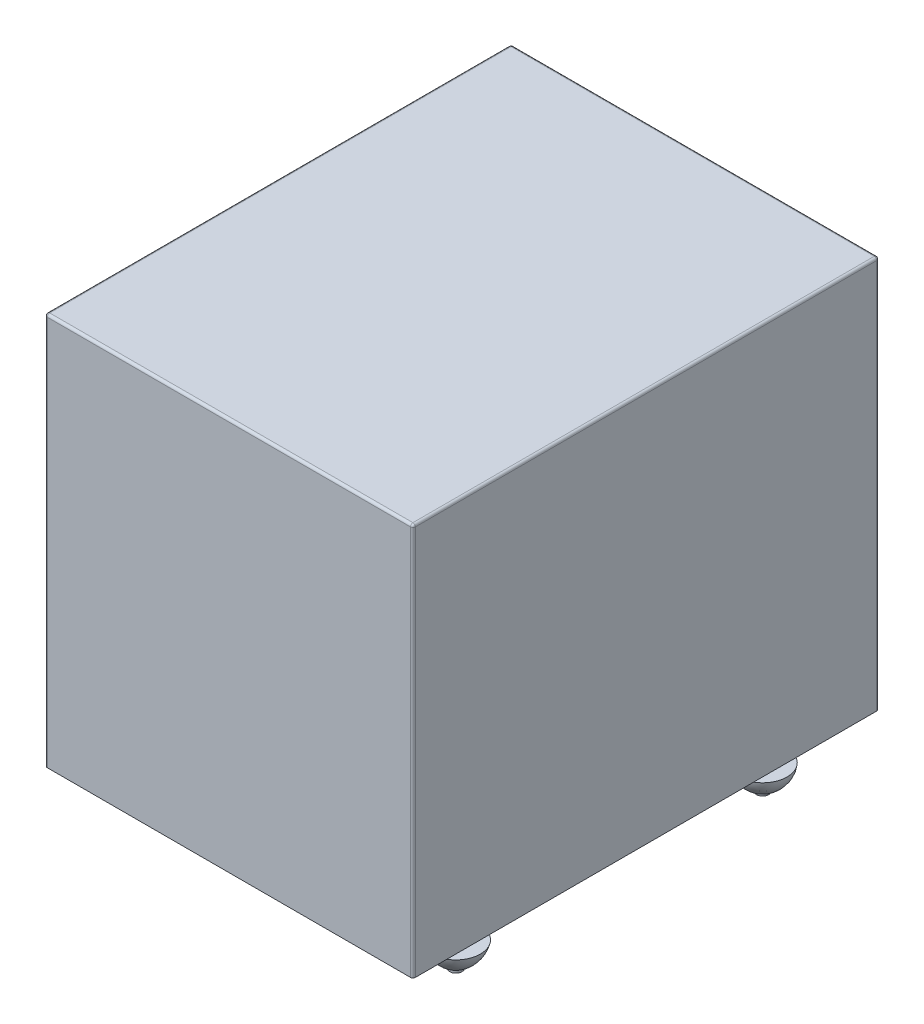
ISO-10303-21;
HEADER;
FILE_DESCRIPTION(('STEP AP214'),'2;1');
FILE_NAME('part.step','',(''),(''),'','','');
FILE_SCHEMA(('AUTOMOTIVE_DESIGN { 1 0 10303 214 1 1 1 1 }'));
ENDSEC;
DATA;
#1=APPLICATION_CONTEXT('core data for automotive mechanical design processes');
#2=APPLICATION_PROTOCOL_DEFINITION('international standard','automotive_design',2000,#1);
#3=PRODUCT_CONTEXT('',#1,'mechanical');
#4=PRODUCT('Part','Part','',(#3));
#5=PRODUCT_RELATED_PRODUCT_CATEGORY('part','',(#4));
#6=PRODUCT_DEFINITION_FORMATION('','',#4);
#7=PRODUCT_DEFINITION_CONTEXT('part definition',#1,'design');
#8=PRODUCT_DEFINITION('design','',#6,#7);
#9=PRODUCT_DEFINITION_SHAPE('','',#8);
#10=(LENGTH_UNIT() NAMED_UNIT(*) SI_UNIT(.MILLI.,.METRE.));
#11=(NAMED_UNIT(*) PLANE_ANGLE_UNIT() SI_UNIT($,.RADIAN.));
#12=(NAMED_UNIT(*) SI_UNIT($,.STERADIAN.) SOLID_ANGLE_UNIT());
#13=UNCERTAINTY_MEASURE_WITH_UNIT(LENGTH_MEASURE(1.E-05),#10,'distance_accuracy_value','');
#14=(GEOMETRIC_REPRESENTATION_CONTEXT(3) GLOBAL_UNCERTAINTY_ASSIGNED_CONTEXT((#13)) GLOBAL_UNIT_ASSIGNED_CONTEXT((#10,
#11,#12)) REPRESENTATION_CONTEXT('',''));
#15=CARTESIAN_POINT('',(0.,0.,0.));
#16=DIRECTION('',(0.,0.,1.));
#17=DIRECTION('',(1.,0.,0.));
#18=AXIS2_PLACEMENT_3D('',#15,#16,#17);
#19=CARTESIAN_POINT('',(6.,-2.,6.25));
#20=DIRECTION('',(0.,1.,0.));
#21=DIRECTION('',(0.,0.,1.));
#22=AXIS2_PLACEMENT_3D('',#19,#20,#21);
#23=CYLINDRICAL_SURFACE('',#22,0.25);
#24=CARTESIAN_POINT('',(6.,0.,6.25));
#25=DIRECTION('',(0.,1.,0.));
#26=DIRECTION('',(0.,0.,1.));
#27=AXIS2_PLACEMENT_3D('',#24,#25,#26);
#28=CIRCLE('',#27,0.25);
#29=CARTESIAN_POINT('',(6.,0.,6.5));
#30=VERTEX_POINT('',#29);
#31=EDGE_CURVE('E190',#30,#30,#28,.F.);
#32=ORIENTED_EDGE('',*,*,#31,.T.);
#33=EDGE_LOOP('',(#32));
#34=FACE_BOUND('',#33,.T.);
#35=CARTESIAN_POINT('',(6.,-1.,6.25));
#36=DIRECTION('',(0.,-1.,0.));
#37=DIRECTION('',(0.,0.,-1.));
#38=AXIS2_PLACEMENT_3D('',#35,#36,#37);
#39=CIRCLE('',#38,0.25);
#40=CARTESIAN_POINT('',(6.,-1.,6.));
#41=VERTEX_POINT('',#40);
#42=EDGE_CURVE('E44',#41,#41,#39,.T.);
#43=ORIENTED_EDGE('',*,*,#42,.F.);
#44=EDGE_LOOP('',(#43));
#45=FACE_BOUND('',#44,.T.);
#46=ADVANCED_FACE('F35',(#34,#45),#23,.T.);
#47=CARTESIAN_POINT('',(7.49999999999999,16.,-9.5));
#48=DIRECTION('',(-1.,0.,0.));
#49=DIRECTION('',(0.,0.,1.));
#50=AXIS2_PLACEMENT_3D('',#47,#48,#49);
#51=PLANE('',#50);
#52=DIRECTION('',(0.,0.,-1.));
#53=VECTOR('',#52,1.);
#54=CARTESIAN_POINT('',(7.49999999999999,0.,-9.5));
#55=LINE('',#54,#53);
#56=CARTESIAN_POINT('',(7.5,0.,9.4));
#57=VERTEX_POINT('',#56);
#58=CARTESIAN_POINT('',(7.49999999999999,0.,-9.4));
#59=VERTEX_POINT('',#58);
#60=EDGE_CURVE('E155',#57,#59,#55,.T.);
#61=ORIENTED_EDGE('',*,*,#60,.T.);
#62=DIRECTION('',(0.,-1.,0.));
#63=VECTOR('',#62,1.);
#64=CARTESIAN_POINT('',(7.49999999999999,16.,-9.4));
#65=LINE('',#64,#63);
#66=CARTESIAN_POINT('',(7.49999999999999,15.9,-9.4));
#67=VERTEX_POINT('',#66);
#68=EDGE_CURVE('E179',#59,#67,#65,.F.);
#69=ORIENTED_EDGE('',*,*,#68,.T.);
#70=DIRECTION('',(0.,0.,-1.));
#71=VECTOR('',#70,1.);
#72=CARTESIAN_POINT('',(7.5,15.9,9.5));
#73=LINE('',#72,#71);
#74=CARTESIAN_POINT('',(7.5,15.9,9.4));
#75=VERTEX_POINT('',#74);
#76=EDGE_CURVE('E175',#67,#75,#73,.F.);
#77=ORIENTED_EDGE('',*,*,#76,.T.);
#78=DIRECTION('',(0.,-1.,0.));
#79=VECTOR('',#78,1.);
#80=CARTESIAN_POINT('',(7.5,16.,9.4));
#81=LINE('',#80,#79);
#82=EDGE_CURVE('E177',#75,#57,#81,.T.);
#83=ORIENTED_EDGE('',*,*,#82,.T.);
#84=EDGE_LOOP('',(#61,#69,#77,#83));
#85=FACE_BOUND('',#84,.T.);
#86=ADVANCED_FACE('F367',(#85),#51,.F.);
#87=CARTESIAN_POINT('',(-7.5,16.,-9.5));
#88=DIRECTION('',(0.,0.,1.));
#89=DIRECTION('',(1.,0.,0.));
#90=AXIS2_PLACEMENT_3D('',#87,#88,#89);
#91=PLANE('',#90);
#92=DIRECTION('',(-1.,0.,0.));
#93=VECTOR('',#92,1.);
#94=CARTESIAN_POINT('',(-7.5,0.,-9.5));
#95=LINE('',#94,#93);
#96=CARTESIAN_POINT('',(7.39999999999999,0.,-9.5));
#97=VERTEX_POINT('',#96);
#98=CARTESIAN_POINT('',(-7.4,0.,-9.5));
#99=VERTEX_POINT('',#98);
#100=EDGE_CURVE('E151',#97,#99,#95,.T.);
#101=ORIENTED_EDGE('',*,*,#100,.T.);
#102=DIRECTION('',(0.,-1.,0.));
#103=VECTOR('',#102,1.);
#104=CARTESIAN_POINT('',(-7.4,16.,-9.5));
#105=LINE('',#104,#103);
#106=CARTESIAN_POINT('',(-7.4,15.9,-9.5));
#107=VERTEX_POINT('',#106);
#108=EDGE_CURVE('E128',#99,#107,#105,.F.);
#109=ORIENTED_EDGE('',*,*,#108,.T.);
#110=DIRECTION('',(-1.,0.,0.));
#111=VECTOR('',#110,1.);
#112=CARTESIAN_POINT('',(7.49999999999999,15.9,-9.5));
#113=LINE('',#112,#111);
#114=CARTESIAN_POINT('',(7.39999999999999,15.9,-9.5));
#115=VERTEX_POINT('',#114);
#116=EDGE_CURVE('E133',#107,#115,#113,.F.);
#117=ORIENTED_EDGE('',*,*,#116,.T.);
#118=DIRECTION('',(0.,-1.,0.));
#119=VECTOR('',#118,1.);
#120=CARTESIAN_POINT('',(7.39999999999999,16.,-9.5));
#121=LINE('',#120,#119);
#122=EDGE_CURVE('E166',#115,#97,#121,.T.);
#123=ORIENTED_EDGE('',*,*,#122,.T.);
#124=EDGE_LOOP('',(#101,#109,#117,#123));
#125=FACE_BOUND('',#124,.T.);
#126=ADVANCED_FACE('F416',(#125),#91,.F.);
#127=CARTESIAN_POINT('',(-7.5,16.,-9.5));
#128=DIRECTION('',(1.,0.,0.));
#129=DIRECTION('',(0.,0.,-1.));
#130=AXIS2_PLACEMENT_3D('',#127,#128,#129);
#131=PLANE('',#130);
#132=DIRECTION('',(0.,0.,1.));
#133=VECTOR('',#132,1.);
#134=CARTESIAN_POINT('',(-7.5,15.9,-9.5));
#135=LINE('',#134,#133);
#136=CARTESIAN_POINT('',(-7.5,15.9,9.4));
#137=VERTEX_POINT('',#136);
#138=CARTESIAN_POINT('',(-7.5,15.9,-9.4));
#139=VERTEX_POINT('',#138);
#140=EDGE_CURVE('E142',#137,#139,#135,.F.);
#141=ORIENTED_EDGE('',*,*,#140,.T.);
#142=DIRECTION('',(0.,-1.,0.));
#143=VECTOR('',#142,1.);
#144=CARTESIAN_POINT('',(-7.5,16.,-9.4));
#145=LINE('',#144,#143);
#146=CARTESIAN_POINT('',(-7.5,0.,-9.4));
#147=VERTEX_POINT('',#146);
#148=EDGE_CURVE('E127',#139,#147,#145,.T.);
#149=ORIENTED_EDGE('',*,*,#148,.T.);
#150=DIRECTION('',(0.,0.,1.));
#151=VECTOR('',#150,1.);
#152=CARTESIAN_POINT('',(-7.5,0.,-9.5));
#153=LINE('',#152,#151);
#154=CARTESIAN_POINT('',(-7.5,0.,9.4));
#155=VERTEX_POINT('',#154);
#156=EDGE_CURVE('E139',#147,#155,#153,.T.);
#157=ORIENTED_EDGE('',*,*,#156,.T.);
#158=DIRECTION('',(0.,-1.,0.));
#159=VECTOR('',#158,1.);
#160=CARTESIAN_POINT('',(-7.5,16.,9.4));
#161=LINE('',#160,#159);
#162=EDGE_CURVE('E145',#155,#137,#161,.F.);
#163=ORIENTED_EDGE('',*,*,#162,.T.);
#164=EDGE_LOOP('',(#141,#149,#157,#163));
#165=FACE_BOUND('',#164,.T.);
#166=ADVANCED_FACE('F138',(#165),#131,.F.);
#167=CARTESIAN_POINT('',(-7.5,16.,9.5));
#168=DIRECTION('',(0.,0.,-1.));
#169=DIRECTION('',(-1.,0.,0.));
#170=AXIS2_PLACEMENT_3D('',#167,#168,#169);
#171=PLANE('',#170);
#172=DIRECTION('',(1.,0.,0.));
#173=VECTOR('',#172,1.);
#174=CARTESIAN_POINT('',(-7.5,15.9,9.5));
#175=LINE('',#174,#173);
#176=CARTESIAN_POINT('',(7.4,15.9,9.5));
#177=VERTEX_POINT('',#176);
#178=CARTESIAN_POINT('',(-7.4,15.9,9.5));
#179=VERTEX_POINT('',#178);
#180=EDGE_CURVE('E169',#177,#179,#175,.F.);
#181=ORIENTED_EDGE('',*,*,#180,.T.);
#182=DIRECTION('',(0.,-1.,0.));
#183=VECTOR('',#182,1.);
#184=CARTESIAN_POINT('',(-7.4,16.,9.5));
#185=LINE('',#184,#183);
#186=CARTESIAN_POINT('',(-7.4,0.,9.5));
#187=VERTEX_POINT('',#186);
#188=EDGE_CURVE('E173',#179,#187,#185,.T.);
#189=ORIENTED_EDGE('',*,*,#188,.T.);
#190=DIRECTION('',(1.,0.,0.));
#191=VECTOR('',#190,1.);
#192=CARTESIAN_POINT('',(-7.5,0.,9.5));
#193=LINE('',#192,#191);
#194=CARTESIAN_POINT('',(7.4,0.,9.5));
#195=VERTEX_POINT('',#194);
#196=EDGE_CURVE('E150',#187,#195,#193,.T.);
#197=ORIENTED_EDGE('',*,*,#196,.T.);
#198=DIRECTION('',(0.,-1.,0.));
#199=VECTOR('',#198,1.);
#200=CARTESIAN_POINT('',(7.4,16.,9.5));
#201=LINE('',#200,#199);
#202=EDGE_CURVE('E171',#195,#177,#201,.F.);
#203=ORIENTED_EDGE('',*,*,#202,.T.);
#204=EDGE_LOOP('',(#181,#189,#197,#203));
#205=FACE_BOUND('',#204,.T.);
#206=ADVANCED_FACE('F398',(#205),#171,.F.);
#207=CARTESIAN_POINT('',(0.,16.,0.));
#208=DIRECTION('',(0.,1.,0.));
#209=DIRECTION('',(0.,0.,1.));
#210=AXIS2_PLACEMENT_3D('',#207,#208,#209);
#211=PLANE('',#210);
#212=DIRECTION('',(-1.,0.,0.));
#213=VECTOR('',#212,1.);
#214=CARTESIAN_POINT('',(-7.5,16.,-9.4));
#215=LINE('',#214,#213);
#216=CARTESIAN_POINT('',(7.39999999999999,16.,-9.4));
#217=VERTEX_POINT('',#216);
#218=CARTESIAN_POINT('',(-7.4,16.,-9.4));
#219=VERTEX_POINT('',#218);
#220=EDGE_CURVE('E185',#217,#219,#215,.T.);
#221=ORIENTED_EDGE('',*,*,#220,.T.);
#222=DIRECTION('',(0.,0.,1.));
#223=VECTOR('',#222,1.);
#224=CARTESIAN_POINT('',(-7.4,16.,9.5));
#225=LINE('',#224,#223);
#226=CARTESIAN_POINT('',(-7.4,16.,9.4));
#227=VERTEX_POINT('',#226);
#228=EDGE_CURVE('E187',#219,#227,#225,.T.);
#229=ORIENTED_EDGE('',*,*,#228,.T.);
#230=DIRECTION('',(1.,0.,0.));
#231=VECTOR('',#230,1.);
#232=CARTESIAN_POINT('',(7.5,16.,9.4));
#233=LINE('',#232,#231);
#234=CARTESIAN_POINT('',(7.4,16.,9.4));
#235=VERTEX_POINT('',#234);
#236=EDGE_CURVE('E181',#227,#235,#233,.T.);
#237=ORIENTED_EDGE('',*,*,#236,.T.);
#238=DIRECTION('',(0.,0.,-1.));
#239=VECTOR('',#238,1.);
#240=CARTESIAN_POINT('',(7.39999999999999,16.,-9.5));
#241=LINE('',#240,#239);
#242=EDGE_CURVE('E183',#235,#217,#241,.T.);
#243=ORIENTED_EDGE('',*,*,#242,.T.);
#244=EDGE_LOOP('',(#221,#229,#237,#243));
#245=FACE_BOUND('',#244,.T.);
#246=ADVANCED_FACE('F624',(#245),#211,.T.);
#247=CARTESIAN_POINT('',(0.,0.,0.));
#248=DIRECTION('',(0.,1.,0.));
#249=DIRECTION('',(0.,0.,1.));
#250=AXIS2_PLACEMENT_3D('',#247,#248,#249);
#251=PLANE('',#250);
#252=CARTESIAN_POINT('',(0.,0.,-8.25));
#253=DIRECTION('',(0.,1.,0.));
#254=DIRECTION('',(0.,0.,1.));
#255=AXIS2_PLACEMENT_3D('',#252,#253,#254);
#256=CIRCLE('',#255,0.25);
#257=CARTESIAN_POINT('',(0.,0.,-8.));
#258=VERTEX_POINT('',#257);
#259=EDGE_CURVE('E237',#258,#258,#256,.F.);
#260=ORIENTED_EDGE('',*,*,#259,.F.);
#261=EDGE_LOOP('',(#260));
#262=FACE_BOUND('',#261,.T.);
#263=CARTESIAN_POINT('',(-6.,0.,-6.25));
#264=DIRECTION('',(0.,1.,0.));
#265=DIRECTION('',(0.,0.,1.));
#266=AXIS2_PLACEMENT_3D('',#263,#264,#265);
#267=CIRCLE('',#266,0.250000000000002);
#268=CARTESIAN_POINT('',(-6.,0.,-6.));
#269=VERTEX_POINT('',#268);
#270=EDGE_CURVE('E234',#269,#269,#267,.F.);
#271=ORIENTED_EDGE('',*,*,#270,.F.);
#272=EDGE_LOOP('',(#271));
#273=FACE_BOUND('',#272,.T.);
#274=CARTESIAN_POINT('',(6.,0.,-6.25));
#275=DIRECTION('',(0.,1.,0.));
#276=DIRECTION('',(0.,0.,1.));
#277=AXIS2_PLACEMENT_3D('',#274,#275,#276);
#278=CIRCLE('',#277,0.249999999999999);
#279=CARTESIAN_POINT('',(6.,0.,-6.));
#280=VERTEX_POINT('',#279);
#281=EDGE_CURVE('E231',#280,#280,#278,.F.);
#282=ORIENTED_EDGE('',*,*,#281,.F.);
#283=EDGE_LOOP('',(#282));
#284=FACE_BOUND('',#283,.T.);
#285=CARTESIAN_POINT('',(-6.,0.,6.25));
#286=DIRECTION('',(0.,1.,0.));
#287=DIRECTION('',(0.,0.,1.));
#288=AXIS2_PLACEMENT_3D('',#285,#286,#287);
#289=CIRCLE('',#288,0.25);
#290=CARTESIAN_POINT('',(-6.,0.,6.5));
#291=VERTEX_POINT('',#290);
#292=EDGE_CURVE('E228',#291,#291,#289,.F.);
#293=ORIENTED_EDGE('',*,*,#292,.F.);
#294=EDGE_LOOP('',(#293));
#295=FACE_BOUND('',#294,.T.);
#296=ORIENTED_EDGE('',*,*,#31,.F.);
#297=EDGE_LOOP('',(#296));
#298=FACE_BOUND('',#297,.T.);
#299=ORIENTED_EDGE('',*,*,#156,.F.);
#300=CARTESIAN_POINT('',(-7.4,0.,-9.4));
#301=DIRECTION('',(0.,1.,0.));
#302=DIRECTION('',(0.,0.,1.));
#303=AXIS2_PLACEMENT_3D('',#300,#301,#302);
#304=CIRCLE('',#303,0.1);
#305=EDGE_CURVE('E123',#147,#99,#304,.F.);
#306=ORIENTED_EDGE('',*,*,#305,.T.);
#307=ORIENTED_EDGE('',*,*,#100,.F.);
#308=CARTESIAN_POINT('',(7.39999999999999,0.,-9.4));
#309=DIRECTION('',(0.,1.,0.));
#310=DIRECTION('',(0.,0.,1.));
#311=AXIS2_PLACEMENT_3D('',#308,#309,#310);
#312=CIRCLE('',#311,0.1);
#313=EDGE_CURVE('E162',#97,#59,#312,.F.);
#314=ORIENTED_EDGE('',*,*,#313,.T.);
#315=ORIENTED_EDGE('',*,*,#60,.F.);
#316=CARTESIAN_POINT('',(7.4,0.,9.4));
#317=DIRECTION('',(0.,1.,0.));
#318=DIRECTION('',(0.,0.,1.));
#319=AXIS2_PLACEMENT_3D('',#316,#317,#318);
#320=CIRCLE('',#319,0.1);
#321=EDGE_CURVE('E144',#57,#195,#320,.F.);
#322=ORIENTED_EDGE('',*,*,#321,.T.);
#323=ORIENTED_EDGE('',*,*,#196,.F.);
#324=CARTESIAN_POINT('',(-7.4,0.,9.4));
#325=DIRECTION('',(0.,1.,0.));
#326=DIRECTION('',(0.,0.,1.));
#327=AXIS2_PLACEMENT_3D('',#324,#325,#326);
#328=CIRCLE('',#327,0.1);
#329=EDGE_CURVE('E134',#187,#155,#328,.F.);
#330=ORIENTED_EDGE('',*,*,#329,.T.);
#331=EDGE_LOOP('',(#299,#306,#307,#314,#315,#322,#323,#330));
#332=FACE_BOUND('',#331,.T.);
#333=ADVANCED_FACE('F147',(#262,#273,#284,#295,#298,#332),#251,.F.);
#334=CARTESIAN_POINT('',(7.4,16.,9.4));
#335=DIRECTION('',(0.,-1.,0.));
#336=DIRECTION('',(0.,0.,-1.));
#337=AXIS2_PLACEMENT_3D('',#334,#335,#336);
#338=CYLINDRICAL_SURFACE('',#337,0.1);
#339=CARTESIAN_POINT('',(7.4,15.9,9.4));
#340=DIRECTION('',(0.,1.,0.));
#341=DIRECTION('',(0.,0.,1.));
#342=AXIS2_PLACEMENT_3D('',#339,#340,#341);
#343=CIRCLE('',#342,0.1);
#344=EDGE_CURVE('E223',#177,#75,#343,.T.);
#345=ORIENTED_EDGE('',*,*,#344,.F.);
#346=ORIENTED_EDGE('',*,*,#202,.F.);
#347=ORIENTED_EDGE('',*,*,#321,.F.);
#348=ORIENTED_EDGE('',*,*,#82,.F.);
#349=EDGE_LOOP('',(#345,#346,#347,#348));
#350=FACE_BOUND('',#349,.T.);
#351=ADVANCED_FACE('F37',(#350),#338,.T.);
#352=CARTESIAN_POINT('',(7.4,15.9,9.4));
#353=DIRECTION('',(0.,0.,1.));
#354=DIRECTION('',(1.,0.,0.));
#355=AXIS2_PLACEMENT_3D('',#352,#353,#354);
#356=SPHERICAL_SURFACE('',#355,0.1);
#357=CARTESIAN_POINT('',(7.4,15.9,9.4));
#358=DIRECTION('',(1.,0.,0.));
#359=DIRECTION('',(0.,0.,-1.));
#360=AXIS2_PLACEMENT_3D('',#357,#358,#359);
#361=CIRCLE('',#360,0.1);
#362=EDGE_CURVE('E217',#177,#235,#361,.F.);
#363=ORIENTED_EDGE('',*,*,#362,.F.);
#364=ORIENTED_EDGE('',*,*,#344,.T.);
#365=CARTESIAN_POINT('',(7.4,15.9,9.4));
#366=DIRECTION('',(0.,0.,1.));
#367=DIRECTION('',(1.,0.,0.));
#368=AXIS2_PLACEMENT_3D('',#365,#366,#367);
#369=CIRCLE('',#368,0.1);
#370=EDGE_CURVE('E220',#235,#75,#369,.F.);
#371=ORIENTED_EDGE('',*,*,#370,.F.);
#372=EDGE_LOOP('',(#363,#364,#371));
#373=FACE_BOUND('',#372,.T.);
#374=ADVANCED_FACE('F390',(#373),#356,.T.);
#375=CARTESIAN_POINT('',(7.39999999999999,16.,-9.4));
#376=DIRECTION('',(0.,-1.,0.));
#377=DIRECTION('',(0.,0.,-1.));
#378=AXIS2_PLACEMENT_3D('',#375,#376,#377);
#379=CYLINDRICAL_SURFACE('',#378,0.1);
#380=ORIENTED_EDGE('',*,*,#313,.F.);
#381=ORIENTED_EDGE('',*,*,#122,.F.);
#382=CARTESIAN_POINT('',(7.39999999999999,15.9,-9.4));
#383=DIRECTION('',(0.,1.,0.));
#384=DIRECTION('',(0.,0.,1.));
#385=AXIS2_PLACEMENT_3D('',#382,#383,#384);
#386=CIRCLE('',#385,0.1);
#387=EDGE_CURVE('E214',#67,#115,#386,.T.);
#388=ORIENTED_EDGE('',*,*,#387,.F.);
#389=ORIENTED_EDGE('',*,*,#68,.F.);
#390=EDGE_LOOP('',(#380,#381,#388,#389));
#391=FACE_BOUND('',#390,.T.);
#392=ADVANCED_FACE('F374',(#391),#379,.T.);
#393=CARTESIAN_POINT('',(7.4,15.9,0.));
#394=DIRECTION('',(0.,0.,1.));
#395=DIRECTION('',(1.,0.,0.));
#396=AXIS2_PLACEMENT_3D('',#393,#394,#395);
#397=CYLINDRICAL_SURFACE('',#396,0.1);
#398=ORIENTED_EDGE('',*,*,#370,.T.);
#399=ORIENTED_EDGE('',*,*,#76,.F.);
#400=CARTESIAN_POINT('',(7.39999999999999,15.9,-9.4));
#401=DIRECTION('',(0.,0.,-1.));
#402=DIRECTION('',(-1.,0.,0.));
#403=AXIS2_PLACEMENT_3D('',#400,#401,#402);
#404=CIRCLE('',#403,0.1);
#405=EDGE_CURVE('E211',#217,#67,#404,.T.);
#406=ORIENTED_EDGE('',*,*,#405,.F.);
#407=ORIENTED_EDGE('',*,*,#242,.F.);
#408=EDGE_LOOP('',(#398,#399,#406,#407));
#409=FACE_BOUND('',#408,.T.);
#410=ADVANCED_FACE('F383',(#409),#397,.T.);
#411=CARTESIAN_POINT('',(0.,15.9,9.4));
#412=DIRECTION('',(-1.,0.,0.));
#413=DIRECTION('',(0.,0.,1.));
#414=AXIS2_PLACEMENT_3D('',#411,#412,#413);
#415=CYLINDRICAL_SURFACE('',#414,0.1);
#416=ORIENTED_EDGE('',*,*,#362,.T.);
#417=ORIENTED_EDGE('',*,*,#236,.F.);
#418=CARTESIAN_POINT('',(-7.4,15.9,9.4));
#419=DIRECTION('',(-1.,0.,0.));
#420=DIRECTION('',(0.,0.,1.));
#421=AXIS2_PLACEMENT_3D('',#418,#419,#420);
#422=CIRCLE('',#421,0.1);
#423=EDGE_CURVE('E208',#179,#227,#422,.T.);
#424=ORIENTED_EDGE('',*,*,#423,.F.);
#425=ORIENTED_EDGE('',*,*,#180,.F.);
#426=EDGE_LOOP('',(#416,#417,#424,#425));
#427=FACE_BOUND('',#426,.T.);
#428=ADVANCED_FACE('F395',(#427),#415,.T.);
#429=CARTESIAN_POINT('',(-7.4,16.,9.4));
#430=DIRECTION('',(0.,-1.,0.));
#431=DIRECTION('',(0.,0.,-1.));
#432=AXIS2_PLACEMENT_3D('',#429,#430,#431);
#433=CYLINDRICAL_SURFACE('',#432,0.1);
#434=ORIENTED_EDGE('',*,*,#329,.F.);
#435=ORIENTED_EDGE('',*,*,#188,.F.);
#436=CARTESIAN_POINT('',(-7.4,15.9,9.4));
#437=DIRECTION('',(0.,1.,0.));
#438=DIRECTION('',(0.,0.,1.));
#439=AXIS2_PLACEMENT_3D('',#436,#437,#438);
#440=CIRCLE('',#439,0.1);
#441=EDGE_CURVE('E205',#137,#179,#440,.T.);
#442=ORIENTED_EDGE('',*,*,#441,.F.);
#443=ORIENTED_EDGE('',*,*,#162,.F.);
#444=EDGE_LOOP('',(#434,#435,#442,#443));
#445=FACE_BOUND('',#444,.T.);
#446=ADVANCED_FACE('F401',(#445),#433,.T.);
#447=CARTESIAN_POINT('',(7.39999999999999,15.9,-9.4));
#448=DIRECTION('',(0.,0.,1.));
#449=DIRECTION('',(1.,0.,0.));
#450=AXIS2_PLACEMENT_3D('',#447,#448,#449);
#451=SPHERICAL_SURFACE('',#450,0.1);
#452=ORIENTED_EDGE('',*,*,#405,.T.);
#453=ORIENTED_EDGE('',*,*,#387,.T.);
#454=CARTESIAN_POINT('',(7.39999999999999,15.9,-9.4));
#455=DIRECTION('',(1.,0.,0.));
#456=DIRECTION('',(0.,1.,0.));
#457=AXIS2_PLACEMENT_3D('',#454,#455,#456);
#458=CIRCLE('',#457,0.1);
#459=EDGE_CURVE('E202',#217,#115,#458,.F.);
#460=ORIENTED_EDGE('',*,*,#459,.F.);
#461=EDGE_LOOP('',(#452,#453,#460));
#462=FACE_BOUND('',#461,.T.);
#463=ADVANCED_FACE('F379',(#462),#451,.T.);
#464=CARTESIAN_POINT('',(-7.4,15.9,9.4));
#465=DIRECTION('',(0.,0.,1.));
#466=DIRECTION('',(1.,0.,0.));
#467=AXIS2_PLACEMENT_3D('',#464,#465,#466);
#468=SPHERICAL_SURFACE('',#467,0.1);
#469=ORIENTED_EDGE('',*,*,#441,.T.);
#470=ORIENTED_EDGE('',*,*,#423,.T.);
#471=CARTESIAN_POINT('',(-7.4,15.9,9.4));
#472=DIRECTION('',(0.,0.,1.));
#473=DIRECTION('',(1.,0.,0.));
#474=AXIS2_PLACEMENT_3D('',#471,#472,#473);
#475=CIRCLE('',#474,0.1);
#476=EDGE_CURVE('E200',#137,#227,#475,.F.);
#477=ORIENTED_EDGE('',*,*,#476,.F.);
#478=EDGE_LOOP('',(#469,#470,#477));
#479=FACE_BOUND('',#478,.T.);
#480=ADVANCED_FACE('F404',(#479),#468,.T.);
#481=CARTESIAN_POINT('',(0.,15.9,-9.4));
#482=DIRECTION('',(1.,0.,0.));
#483=DIRECTION('',(0.,0.,-1.));
#484=AXIS2_PLACEMENT_3D('',#481,#482,#483);
#485=CYLINDRICAL_SURFACE('',#484,0.1);
#486=ORIENTED_EDGE('',*,*,#459,.T.);
#487=ORIENTED_EDGE('',*,*,#116,.F.);
#488=CARTESIAN_POINT('',(-7.4,15.9,-9.4));
#489=DIRECTION('',(-1.,0.,0.));
#490=DIRECTION('',(0.,0.,1.));
#491=AXIS2_PLACEMENT_3D('',#488,#489,#490);
#492=CIRCLE('',#491,0.1);
#493=EDGE_CURVE('E197',#219,#107,#492,.T.);
#494=ORIENTED_EDGE('',*,*,#493,.F.);
#495=ORIENTED_EDGE('',*,*,#220,.F.);
#496=EDGE_LOOP('',(#486,#487,#494,#495));
#497=FACE_BOUND('',#496,.T.);
#498=ADVANCED_FACE('F414',(#497),#485,.T.);
#499=CARTESIAN_POINT('',(-7.4,15.9,0.));
#500=DIRECTION('',(0.,0.,-1.));
#501=DIRECTION('',(-1.,0.,0.));
#502=AXIS2_PLACEMENT_3D('',#499,#500,#501);
#503=CYLINDRICAL_SURFACE('',#502,0.1);
#504=ORIENTED_EDGE('',*,*,#476,.T.);
#505=ORIENTED_EDGE('',*,*,#228,.F.);
#506=CARTESIAN_POINT('',(-7.4,15.9,-9.4));
#507=DIRECTION('',(0.,0.,-1.));
#508=DIRECTION('',(-1.,0.,0.));
#509=AXIS2_PLACEMENT_3D('',#506,#507,#508);
#510=CIRCLE('',#509,0.1);
#511=EDGE_CURVE('E193',#139,#219,#510,.T.);
#512=ORIENTED_EDGE('',*,*,#511,.F.);
#513=ORIENTED_EDGE('',*,*,#140,.F.);
#514=EDGE_LOOP('',(#504,#505,#512,#513));
#515=FACE_BOUND('',#514,.T.);
#516=ADVANCED_FACE('F407',(#515),#503,.T.);
#517=CARTESIAN_POINT('',(-7.4,15.9,-9.4));
#518=DIRECTION('',(0.,0.,1.));
#519=DIRECTION('',(1.,0.,0.));
#520=AXIS2_PLACEMENT_3D('',#517,#518,#519);
#521=SPHERICAL_SURFACE('',#520,0.1);
#522=ORIENTED_EDGE('',*,*,#511,.T.);
#523=ORIENTED_EDGE('',*,*,#493,.T.);
#524=CARTESIAN_POINT('',(-7.4,15.9,-9.4));
#525=DIRECTION('',(0.,1.,0.));
#526=DIRECTION('',(0.,0.,1.));
#527=AXIS2_PLACEMENT_3D('',#524,#525,#526);
#528=CIRCLE('',#527,0.1);
#529=EDGE_CURVE('E191',#139,#107,#528,.F.);
#530=ORIENTED_EDGE('',*,*,#529,.F.);
#531=EDGE_LOOP('',(#522,#523,#530));
#532=FACE_BOUND('',#531,.T.);
#533=ADVANCED_FACE('F411',(#532),#521,.T.);
#534=CARTESIAN_POINT('',(-7.4,16.,-9.4));
#535=DIRECTION('',(0.,-1.,0.));
#536=DIRECTION('',(0.,0.,-1.));
#537=AXIS2_PLACEMENT_3D('',#534,#535,#536);
#538=CYLINDRICAL_SURFACE('',#537,0.1);
#539=ORIENTED_EDGE('',*,*,#529,.T.);
#540=ORIENTED_EDGE('',*,*,#108,.F.);
#541=ORIENTED_EDGE('',*,*,#305,.F.);
#542=ORIENTED_EDGE('',*,*,#148,.F.);
#543=EDGE_LOOP('',(#539,#540,#541,#542));
#544=FACE_BOUND('',#543,.T.);
#545=ADVANCED_FACE('F126',(#544),#538,.T.);
#546=CARTESIAN_POINT('',(-6.,-2.,6.25));
#547=DIRECTION('',(0.,1.,0.));
#548=DIRECTION('',(0.,0.,1.));
#549=AXIS2_PLACEMENT_3D('',#546,#547,#548);
#550=CYLINDRICAL_SURFACE('',#549,0.25);
#551=CARTESIAN_POINT('',(-6.,-1.,6.25));
#552=DIRECTION('',(0.,1.,0.));
#553=DIRECTION('',(0.,0.,1.));
#554=AXIS2_PLACEMENT_3D('',#551,#552,#553);
#555=CIRCLE('',#554,0.25);
#556=CARTESIAN_POINT('',(-6.,-1.,6.5));
#557=VERTEX_POINT('',#556);
#558=EDGE_CURVE('E248',#557,#557,#555,.T.);
#559=ORIENTED_EDGE('',*,*,#558,.T.);
#560=EDGE_LOOP('',(#559));
#561=FACE_BOUND('',#560,.T.);
#562=ORIENTED_EDGE('',*,*,#292,.T.);
#563=EDGE_LOOP('',(#562));
#564=FACE_BOUND('',#563,.T.);
#565=ADVANCED_FACE('F447',(#561,#564),#550,.T.);
#566=CARTESIAN_POINT('',(6.,-2.,-6.25));
#567=DIRECTION('',(0.,1.,0.));
#568=DIRECTION('',(0.,0.,1.));
#569=AXIS2_PLACEMENT_3D('',#566,#567,#568);
#570=CYLINDRICAL_SURFACE('',#569,0.249999999999999);
#571=CARTESIAN_POINT('',(6.,-0.999999999999999,-6.25));
#572=DIRECTION('',(0.,1.,0.));
#573=DIRECTION('',(0.,0.,1.));
#574=AXIS2_PLACEMENT_3D('',#571,#572,#573);
#575=CIRCLE('',#574,0.249999999999999);
#576=CARTESIAN_POINT('',(6.,-0.999999999999999,-6.));
#577=VERTEX_POINT('',#576);
#578=EDGE_CURVE('E257',#577,#577,#575,.T.);
#579=ORIENTED_EDGE('',*,*,#578,.T.);
#580=EDGE_LOOP('',(#579));
#581=FACE_BOUND('',#580,.T.);
#582=ORIENTED_EDGE('',*,*,#281,.T.);
#583=EDGE_LOOP('',(#582));
#584=FACE_BOUND('',#583,.T.);
#585=ADVANCED_FACE('F450',(#581,#584),#570,.T.);
#586=CARTESIAN_POINT('',(-6.,-2.,-6.25));
#587=DIRECTION('',(0.,1.,0.));
#588=DIRECTION('',(0.,0.,1.));
#589=AXIS2_PLACEMENT_3D('',#586,#587,#588);
#590=CYLINDRICAL_SURFACE('',#589,0.250000000000002);
#591=CARTESIAN_POINT('',(-6.,-1.,-6.25));
#592=DIRECTION('',(0.,1.,0.));
#593=DIRECTION('',(0.,0.,1.));
#594=AXIS2_PLACEMENT_3D('',#591,#592,#593);
#595=CIRCLE('',#594,0.250000000000002);
#596=CARTESIAN_POINT('',(-6.,-1.,-6.));
#597=VERTEX_POINT('',#596);
#598=EDGE_CURVE('E240',#597,#597,#595,.T.);
#599=ORIENTED_EDGE('',*,*,#598,.T.);
#600=EDGE_LOOP('',(#599));
#601=FACE_BOUND('',#600,.T.);
#602=ORIENTED_EDGE('',*,*,#270,.T.);
#603=EDGE_LOOP('',(#602));
#604=FACE_BOUND('',#603,.T.);
#605=ADVANCED_FACE('F458',(#601,#604),#590,.T.);
#606=CARTESIAN_POINT('',(0.,-2.,-8.25));
#607=DIRECTION('',(0.,1.,0.));
#608=DIRECTION('',(0.,0.,1.));
#609=AXIS2_PLACEMENT_3D('',#606,#607,#608);
#610=CYLINDRICAL_SURFACE('',#609,0.25);
#611=CARTESIAN_POINT('',(0.,-1.,-8.25));
#612=DIRECTION('',(0.,1.,0.));
#613=DIRECTION('',(0.,0.,1.));
#614=AXIS2_PLACEMENT_3D('',#611,#612,#613);
#615=CIRCLE('',#614,0.25);
#616=CARTESIAN_POINT('',(0.,-1.,-8.));
#617=VERTEX_POINT('',#616);
#618=EDGE_CURVE('E264',#617,#617,#615,.T.);
#619=ORIENTED_EDGE('',*,*,#618,.T.);
#620=EDGE_LOOP('',(#619));
#621=FACE_BOUND('',#620,.T.);
#622=ORIENTED_EDGE('',*,*,#259,.T.);
#623=EDGE_LOOP('',(#622));
#624=FACE_BOUND('',#623,.T.);
#625=ADVANCED_FACE('F338',(#621,#624),#610,.T.);
#626=CARTESIAN_POINT('',(-6.,-2.,-6.25));
#627=CARTESIAN_POINT('',(-6.,-1.62839039192073,-5.44003817454615));
#628=CARTESIAN_POINT('',(-6.,-1.,-5.25));
#629=B_SPLINE_CURVE_WITH_KNOTS('',2,(#626,#627,#628),.UNSPECIFIED.,.F.,.F.,(3,3),(0.,
0.619923650907754),.UNSPECIFIED.);
#630=CARTESIAN_POINT('',(-6.,-2.,-6.25));
#631=DIRECTION('',(0.,-1.,0.));
#632=AXIS1_PLACEMENT('',#630,#631);
#633=SURFACE_OF_REVOLUTION('',#629,#632);
#634=CARTESIAN_POINT('',(-6.,-1.,-6.25));
#635=DIRECTION('',(0.,-1.,0.));
#636=DIRECTION('',(0.,0.,-1.));
#637=AXIS2_PLACEMENT_3D('',#634,#635,#636);
#638=CIRCLE('',#637,1.);
#639=CARTESIAN_POINT('',(-6.,-1.,-7.25));
#640=VERTEX_POINT('',#639);
#641=EDGE_CURVE('E244',#640,#640,#638,.T.);
#642=ORIENTED_EDGE('',*,*,#641,.T.);
#643=EDGE_LOOP('',(#642));
#644=FACE_BOUND('',#643,.T.);
#645=CARTESIAN_POINT('',(-6.,-1.87061775298902,-6.25));
#646=DIRECTION('',(0.,-1.,0.));
#647=DIRECTION('',(0.,0.,-1.));
#648=AXIS2_PLACEMENT_3D('',#645,#646,#647);
#649=CIRCLE('',#648,0.250000000000002);
#650=CARTESIAN_POINT('',(-6.,-1.87061775298902,-6.5));
#651=VERTEX_POINT('',#650);
#652=EDGE_CURVE('E243',#651,#651,#649,.T.);
#653=ORIENTED_EDGE('',*,*,#652,.F.);
#654=EDGE_LOOP('',(#653));
#655=FACE_BOUND('',#654,.T.);
#656=ADVANCED_FACE('F334',(#644,#655),#633,.F.);
#657=CARTESIAN_POINT('',(-6.,-1.,-6.25));
#658=DIRECTION('',(0.,1.,0.));
#659=DIRECTION('',(0.,0.,1.));
#660=AXIS2_PLACEMENT_3D('',#657,#658,#659);
#661=PLANE('',#660);
#662=ORIENTED_EDGE('',*,*,#598,.F.);
#663=EDGE_LOOP('',(#662));
#664=FACE_BOUND('',#663,.T.);
#665=ORIENTED_EDGE('',*,*,#641,.F.);
#666=EDGE_LOOP('',(#665));
#667=FACE_BOUND('',#666,.T.);
#668=ADVANCED_FACE('F330',(#664,#667),#661,.T.);
#669=CARTESIAN_POINT('',(-6.,-2.,-6.25));
#670=DIRECTION('',(0.,-1.,0.));
#671=DIRECTION('',(0.,0.,-1.));
#672=AXIS2_PLACEMENT_3D('',#669,#670,#671);
#673=PLANE('',#672);
#674=CARTESIAN_POINT('',(-6.,-2.,-6.25));
#675=VERTEX_POINT('',#674);
#676=VERTEX_LOOP('',#675);
#677=FACE_BOUND('',#676,.T.);
#678=CARTESIAN_POINT('',(-6.,-2.,-6.25));
#679=DIRECTION('',(0.,-1.,0.));
#680=DIRECTION('',(0.,0.,-1.));
#681=AXIS2_PLACEMENT_3D('',#678,#679,#680);
#682=CIRCLE('',#681,0.250000000000002);
#683=CARTESIAN_POINT('',(-6.,-2.,-6.5));
#684=VERTEX_POINT('',#683);
#685=EDGE_CURVE('E353',#684,#684,#682,.T.);
#686=ORIENTED_EDGE('',*,*,#685,.T.);
#687=EDGE_LOOP('',(#686));
#688=FACE_BOUND('',#687,.T.);
#689=ADVANCED_FACE('F333',(#677,#688),#673,.T.);
#690=ORIENTED_EDGE('',*,*,#652,.T.);
#691=EDGE_LOOP('',(#690));
#692=FACE_BOUND('',#691,.T.);
#693=ORIENTED_EDGE('',*,*,#685,.F.);
#694=EDGE_LOOP('',(#693));
#695=FACE_BOUND('',#694,.T.);
#696=ADVANCED_FACE('F328',(#692,#695),#590,.T.);
#697=CARTESIAN_POINT('',(-6.,-2.,6.25));
#698=CARTESIAN_POINT('',(-6.,-1.6303981095737,7.06480888464154));
#699=CARTESIAN_POINT('',(-6.,-1.,7.25));
#700=B_SPLINE_CURVE_WITH_KNOTS('',2,(#697,#698,#699),.UNSPECIFIED.,.F.,.F.,(3,3),(0.,
0.629617769283207),.UNSPECIFIED.);
#701=CARTESIAN_POINT('',(-6.,-2.,6.25));
#702=DIRECTION('',(0.,-1.,0.));
#703=AXIS1_PLACEMENT('',#701,#702);
#704=SURFACE_OF_REVOLUTION('',#700,#703);
#705=CARTESIAN_POINT('',(-6.,-1.,6.25));
#706=DIRECTION('',(0.,-1.,0.));
#707=DIRECTION('',(0.,0.,-1.));
#708=AXIS2_PLACEMENT_3D('',#705,#706,#707);
#709=CIRCLE('',#708,1.);
#710=CARTESIAN_POINT('',(-6.,-1.,5.25));
#711=VERTEX_POINT('',#710);
#712=EDGE_CURVE('E252',#711,#711,#709,.T.);
#713=ORIENTED_EDGE('',*,*,#712,.T.);
#714=EDGE_LOOP('',(#713));
#715=FACE_BOUND('',#714,.T.);
#716=CARTESIAN_POINT('',(-6.,-1.8719434303823,6.25));
#717=DIRECTION('',(0.,-1.,0.));
#718=DIRECTION('',(0.,0.,-1.));
#719=AXIS2_PLACEMENT_3D('',#716,#717,#718);
#720=CIRCLE('',#719,0.250000000000001);
#721=CARTESIAN_POINT('',(-6.,-1.8719434303823,6.));
#722=VERTEX_POINT('',#721);
#723=EDGE_CURVE('E251',#722,#722,#720,.T.);
#724=ORIENTED_EDGE('',*,*,#723,.F.);
#725=EDGE_LOOP('',(#724));
#726=FACE_BOUND('',#725,.T.);
#727=ADVANCED_FACE('F325',(#715,#726),#704,.F.);
#728=CARTESIAN_POINT('',(-6.,-1.,6.25));
#729=DIRECTION('',(0.,1.,0.));
#730=DIRECTION('',(0.,0.,1.));
#731=AXIS2_PLACEMENT_3D('',#728,#729,#730);
#732=PLANE('',#731);
#733=ORIENTED_EDGE('',*,*,#558,.F.);
#734=EDGE_LOOP('',(#733));
#735=FACE_BOUND('',#734,.T.);
#736=ORIENTED_EDGE('',*,*,#712,.F.);
#737=EDGE_LOOP('',(#736));
#738=FACE_BOUND('',#737,.T.);
#739=ADVANCED_FACE('F306',(#735,#738),#732,.T.);
#740=CARTESIAN_POINT('',(-6.,-2.,6.25));
#741=DIRECTION('',(0.,1.,0.));
#742=DIRECTION('',(0.,0.,1.));
#743=AXIS2_PLACEMENT_3D('',#740,#741,#742);
#744=PLANE('',#743);
#745=CARTESIAN_POINT('',(-6.,-2.,6.25));
#746=VERTEX_POINT('',#745);
#747=VERTEX_LOOP('',#746);
#748=FACE_BOUND('',#747,.T.);
#749=CARTESIAN_POINT('',(-6.,-2.,6.25));
#750=DIRECTION('',(0.,-1.,0.));
#751=DIRECTION('',(0.,0.,1.));
#752=AXIS2_PLACEMENT_3D('',#749,#750,#751);
#753=CIRCLE('',#752,0.25);
#754=CARTESIAN_POINT('',(-6.,-2.,6.5));
#755=VERTEX_POINT('',#754);
#756=EDGE_CURVE('E359',#755,#755,#753,.T.);
#757=ORIENTED_EDGE('',*,*,#756,.T.);
#758=EDGE_LOOP('',(#757));
#759=FACE_BOUND('',#758,.T.);
#760=ADVANCED_FACE('F452',(#748,#759),#744,.F.);
#761=ORIENTED_EDGE('',*,*,#723,.T.);
#762=EDGE_LOOP('',(#761));
#763=FACE_BOUND('',#762,.T.);
#764=ORIENTED_EDGE('',*,*,#756,.F.);
#765=EDGE_LOOP('',(#764));
#766=FACE_BOUND('',#765,.T.);
#767=ADVANCED_FACE('F304',(#763,#766),#550,.T.);
#768=CARTESIAN_POINT('',(6.,-1.,7.25));
#769=CARTESIAN_POINT('',(6.,-1.64841356490774,7.10830204123841));
#770=CARTESIAN_POINT('',(6.,-2.,6.25));
#771=B_SPLINE_CURVE_WITH_KNOTS('',2,(#768,#769,#770),.UNSPECIFIED.,.F.,.F.,(3,3),(0.,
0.716604082476312),.UNSPECIFIED.);
#772=CARTESIAN_POINT('',(6.,-2.,6.25));
#773=DIRECTION('',(0.,-1.,0.));
#774=AXIS1_PLACEMENT('',#772,#773);
#775=SURFACE_OF_REVOLUTION('',#771,#774);
#776=CARTESIAN_POINT('',(6.,-1.,6.25));
#777=DIRECTION('',(0.,-1.,0.));
#778=DIRECTION('',(0.,0.,-1.));
#779=AXIS2_PLACEMENT_3D('',#776,#777,#778);
#780=CIRCLE('',#779,1.);
#781=CARTESIAN_POINT('',(6.,-1.,5.25));
#782=VERTEX_POINT('',#781);
#783=EDGE_CURVE('E263',#782,#782,#780,.T.);
#784=ORIENTED_EDGE('',*,*,#783,.T.);
#785=EDGE_LOOP('',(#784));
#786=FACE_BOUND('',#785,.T.);
#787=CARTESIAN_POINT('',(6.,-1.88326847167419,6.25));
#788=DIRECTION('',(0.,-1.,0.));
#789=DIRECTION('',(0.,0.,-1.));
#790=AXIS2_PLACEMENT_3D('',#787,#788,#789);
#791=CIRCLE('',#790,0.250000000000001);
#792=CARTESIAN_POINT('',(6.,-1.88326847167419,6.));
#793=VERTEX_POINT('',#792);
#794=EDGE_CURVE('E11',#793,#793,#791,.F.);
#795=ORIENTED_EDGE('',*,*,#794,.T.);
#796=EDGE_LOOP('',(#795));
#797=FACE_BOUND('',#796,.T.);
#798=ADVANCED_FACE('F300',(#786,#797),#775,.T.);
#799=CARTESIAN_POINT('',(6.,-1.,6.25));
#800=DIRECTION('',(0.,-1.,0.));
#801=DIRECTION('',(0.,0.,-1.));
#802=AXIS2_PLACEMENT_3D('',#799,#800,#801);
#803=PLANE('',#802);
#804=ORIENTED_EDGE('',*,*,#42,.T.);
#805=EDGE_LOOP('',(#804));
#806=FACE_BOUND('',#805,.T.);
#807=ORIENTED_EDGE('',*,*,#783,.F.);
#808=EDGE_LOOP('',(#807));
#809=FACE_BOUND('',#808,.T.);
#810=ADVANCED_FACE('F296',(#806,#809),#803,.F.);
#811=CARTESIAN_POINT('',(6.,-2.,6.25));
#812=DIRECTION('',(0.,-1.,0.));
#813=DIRECTION('',(0.,0.,-1.));
#814=AXIS2_PLACEMENT_3D('',#811,#812,#813);
#815=PLANE('',#814);
#816=CARTESIAN_POINT('',(6.,-2.,6.25));
#817=VERTEX_POINT('',#816);
#818=VERTEX_LOOP('',#817);
#819=FACE_BOUND('',#818,.T.);
#820=CARTESIAN_POINT('',(6.,-2.,6.25));
#821=DIRECTION('',(0.,-1.,0.));
#822=DIRECTION('',(0.,0.,-1.));
#823=AXIS2_PLACEMENT_3D('',#820,#821,#822);
#824=CIRCLE('',#823,0.25);
#825=CARTESIAN_POINT('',(6.,-2.,6.));
#826=VERTEX_POINT('',#825);
#827=EDGE_CURVE('E194',#826,#826,#824,.T.);
#828=ORIENTED_EDGE('',*,*,#827,.T.);
#829=EDGE_LOOP('',(#828));
#830=FACE_BOUND('',#829,.T.);
#831=ADVANCED_FACE('F299',(#819,#830),#815,.T.);
#832=ORIENTED_EDGE('',*,*,#827,.F.);
#833=EDGE_LOOP('',(#832));
#834=FACE_BOUND('',#833,.T.);
#835=ORIENTED_EDGE('',*,*,#794,.F.);
#836=EDGE_LOOP('',(#835));
#837=FACE_BOUND('',#836,.T.);
#838=ADVANCED_FACE('F293',(#834,#837),#23,.T.);
#839=CARTESIAN_POINT('',(5.99999999999999,-2.,-6.25));
#840=CARTESIAN_POINT('',(5.99999999999999,-1.67362202210002,-7.16916064044728));
#841=CARTESIAN_POINT('',(5.99999999999999,-1.,-7.25));
#842=B_SPLINE_CURVE_WITH_KNOTS('',2,(#839,#840,#841),.UNSPECIFIED.,.F.,.F.,(3,3),(0.,
0.838321280881377),.UNSPECIFIED.);
#843=CARTESIAN_POINT('',(5.99999999999999,-2.,-6.25));
#844=DIRECTION('',(0.,-1.,0.));
#845=AXIS1_PLACEMENT('',#843,#844);
#846=SURFACE_OF_REVOLUTION('',#842,#845);
#847=CARTESIAN_POINT('',(5.99999999999999,-0.999999999999999,-6.25));
#848=DIRECTION('',(0.,-1.,0.));
#849=DIRECTION('',(0.,0.,-1.));
#850=AXIS2_PLACEMENT_3D('',#847,#848,#849);
#851=CIRCLE('',#850,1.);
#852=CARTESIAN_POINT('',(5.99999999999999,-1.,-7.25));
#853=VERTEX_POINT('',#852);
#854=EDGE_CURVE('E261',#853,#853,#851,.T.);
#855=ORIENTED_EDGE('',*,*,#854,.T.);
#856=EDGE_LOOP('',(#855));
#857=FACE_BOUND('',#856,.T.);
#858=CARTESIAN_POINT('',(5.99999999999999,-1.89754427454832,-6.25));
#859=DIRECTION('',(0.,-1.,0.));
#860=DIRECTION('',(0.,0.,-1.));
#861=AXIS2_PLACEMENT_3D('',#858,#859,#860);
#862=CIRCLE('',#861,0.249999999999999);
#863=CARTESIAN_POINT('',(5.99999999999999,-1.89754427454832,-6.5));
#864=VERTEX_POINT('',#863);
#865=EDGE_CURVE('E260',#864,#864,#862,.T.);
#866=ORIENTED_EDGE('',*,*,#865,.F.);
#867=EDGE_LOOP('',(#866));
#868=FACE_BOUND('',#867,.T.);
#869=ADVANCED_FACE('F288',(#857,#868),#846,.F.);
#870=CARTESIAN_POINT('',(5.99999999999999,-0.999999999999999,-6.25));
#871=DIRECTION('',(0.,1.,0.));
#872=DIRECTION('',(0.,0.,1.));
#873=AXIS2_PLACEMENT_3D('',#870,#871,#872);
#874=PLANE('',#873);
#875=ORIENTED_EDGE('',*,*,#578,.F.);
#876=EDGE_LOOP('',(#875));
#877=FACE_BOUND('',#876,.T.);
#878=ORIENTED_EDGE('',*,*,#854,.F.);
#879=EDGE_LOOP('',(#878));
#880=FACE_BOUND('',#879,.T.);
#881=ADVANCED_FACE('F292',(#877,#880),#874,.T.);
#882=CARTESIAN_POINT('',(6.,-2.,-6.25));
#883=DIRECTION('',(0.,1.,0.));
#884=DIRECTION('',(0.,0.,1.));
#885=AXIS2_PLACEMENT_3D('',#882,#883,#884);
#886=PLANE('',#885);
#887=CARTESIAN_POINT('',(5.99999999999999,-2.,-6.25));
#888=VERTEX_POINT('',#887);
#889=VERTEX_LOOP('',#888);
#890=FACE_BOUND('',#889,.T.);
#891=CARTESIAN_POINT('',(6.,-2.,-6.25));
#892=DIRECTION('',(0.,-1.,0.));
#893=DIRECTION('',(0.,0.,1.));
#894=AXIS2_PLACEMENT_3D('',#891,#892,#893);
#895=CIRCLE('',#894,0.249999999999999);
#896=CARTESIAN_POINT('',(6.,-2.,-6.));
#897=VERTEX_POINT('',#896);
#898=EDGE_CURVE('E356',#897,#897,#895,.T.);
#899=ORIENTED_EDGE('',*,*,#898,.T.);
#900=EDGE_LOOP('',(#899));
#901=FACE_BOUND('',#900,.T.);
#902=ADVANCED_FACE('F461',(#890,#901),#886,.F.);
#903=ORIENTED_EDGE('',*,*,#865,.T.);
#904=EDGE_LOOP('',(#903));
#905=FACE_BOUND('',#904,.T.);
#906=ORIENTED_EDGE('',*,*,#898,.F.);
#907=EDGE_LOOP('',(#906));
#908=FACE_BOUND('',#907,.T.);
#909=ADVANCED_FACE('F460',(#905,#908),#570,.T.);
#910=CARTESIAN_POINT('',(0.,-2.,-8.25));
#911=CARTESIAN_POINT('',(0.,-1.65123976500743,-8.854156938084));
#912=CARTESIAN_POINT('',(0.,-1.,-9.25));
#913=B_SPLINE_CURVE_WITH_KNOTS('',2,(#910,#911,#912),.UNSPECIFIED.,.F.,.F.,(3,3),(0.,
0.716230024263242),.UNSPECIFIED.);
#914=CARTESIAN_POINT('',(0.,-2.,-8.25));
#915=DIRECTION('',(0.,-1.,0.));
#916=AXIS1_PLACEMENT('',#914,#915);
#917=SURFACE_OF_REVOLUTION('',#913,#916);
#918=CARTESIAN_POINT('',(0.,-1.,-8.25));
#919=DIRECTION('',(0.,-1.,0.));
#920=DIRECTION('',(0.,0.,-1.));
#921=AXIS2_PLACEMENT_3D('',#918,#919,#920);
#922=CIRCLE('',#921,1.);
#923=CARTESIAN_POINT('',(0.,-1.,-9.25));
#924=VERTEX_POINT('',#923);
#925=EDGE_CURVE('E266',#924,#924,#922,.T.);
#926=ORIENTED_EDGE('',*,*,#925,.T.);
#927=EDGE_LOOP('',(#926));
#928=FACE_BOUND('',#927,.T.);
#929=CARTESIAN_POINT('',(0.,-1.83616798303898,-8.25));
#930=DIRECTION('',(0.,-1.,0.));
#931=DIRECTION('',(0.,0.,-1.));
#932=AXIS2_PLACEMENT_3D('',#929,#930,#931);
#933=CIRCLE('',#932,0.249999999999999);
#934=CARTESIAN_POINT('',(0.,-1.83616798303898,-8.5));
#935=VERTEX_POINT('',#934);
#936=EDGE_CURVE('E39',#935,#935,#933,.T.);
#937=ORIENTED_EDGE('',*,*,#936,.F.);
#938=EDGE_LOOP('',(#937));
#939=FACE_BOUND('',#938,.T.);
#940=ADVANCED_FACE('F485',(#928,#939),#917,.F.);
#941=CARTESIAN_POINT('',(0.,-1.,-8.25));
#942=DIRECTION('',(0.,1.,0.));
#943=DIRECTION('',(0.,0.,1.));
#944=AXIS2_PLACEMENT_3D('',#941,#942,#943);
#945=PLANE('',#944);
#946=ORIENTED_EDGE('',*,*,#618,.F.);
#947=EDGE_LOOP('',(#946));
#948=FACE_BOUND('',#947,.T.);
#949=ORIENTED_EDGE('',*,*,#925,.F.);
#950=EDGE_LOOP('',(#949));
#951=FACE_BOUND('',#950,.T.);
#952=ADVANCED_FACE('F479',(#948,#951),#945,.T.);
#953=CARTESIAN_POINT('',(0.,-2.,-8.25));
#954=DIRECTION('',(0.,-1.,0.));
#955=DIRECTION('',(0.,0.,-1.));
#956=AXIS2_PLACEMENT_3D('',#953,#954,#955);
#957=PLANE('',#956);
#958=CARTESIAN_POINT('',(0.,-2.,-8.25));
#959=VERTEX_POINT('',#958);
#960=VERTEX_LOOP('',#959);
#961=FACE_BOUND('',#960,.T.);
#962=CARTESIAN_POINT('',(0.,-2.,-8.25));
#963=DIRECTION('',(0.,-1.,0.));
#964=DIRECTION('',(0.,0.,-1.));
#965=AXIS2_PLACEMENT_3D('',#962,#963,#964);
#966=CIRCLE('',#965,0.25);
#967=CARTESIAN_POINT('',(0.,-2.,-8.5));
#968=VERTEX_POINT('',#967);
#969=EDGE_CURVE('E247',#968,#968,#966,.T.);
#970=ORIENTED_EDGE('',*,*,#969,.T.);
#971=EDGE_LOOP('',(#970));
#972=FACE_BOUND('',#971,.T.);
#973=ADVANCED_FACE('F340',(#961,#972),#957,.T.);
#974=ORIENTED_EDGE('',*,*,#936,.T.);
#975=EDGE_LOOP('',(#974));
#976=FACE_BOUND('',#975,.T.);
#977=ORIENTED_EDGE('',*,*,#969,.F.);
#978=EDGE_LOOP('',(#977));
#979=FACE_BOUND('',#978,.T.);
#980=ADVANCED_FACE('F470',(#976,#979),#610,.T.);
#981=CLOSED_SHELL('',(#46,#86,#126,#166,#206,#246,#333,#351,#374,#392,#410,#428,#446,#463,#480,
#498,#516,#533,#545,#565,#585,#605,#625,#656,#668,#689,#696,#727,#739,#760,#767,#798,#810,#831,
#838,#869,#881,#902,#909,#940,#952,#973,#980));
#982=MANIFOLD_SOLID_BREP('B2',#981);
#983=ADVANCED_BREP_SHAPE_REPRESENTATION('',(#18,#982),#14);
#984=SHAPE_DEFINITION_REPRESENTATION(#9,#983);
ENDSEC;
END-ISO-10303-21;
